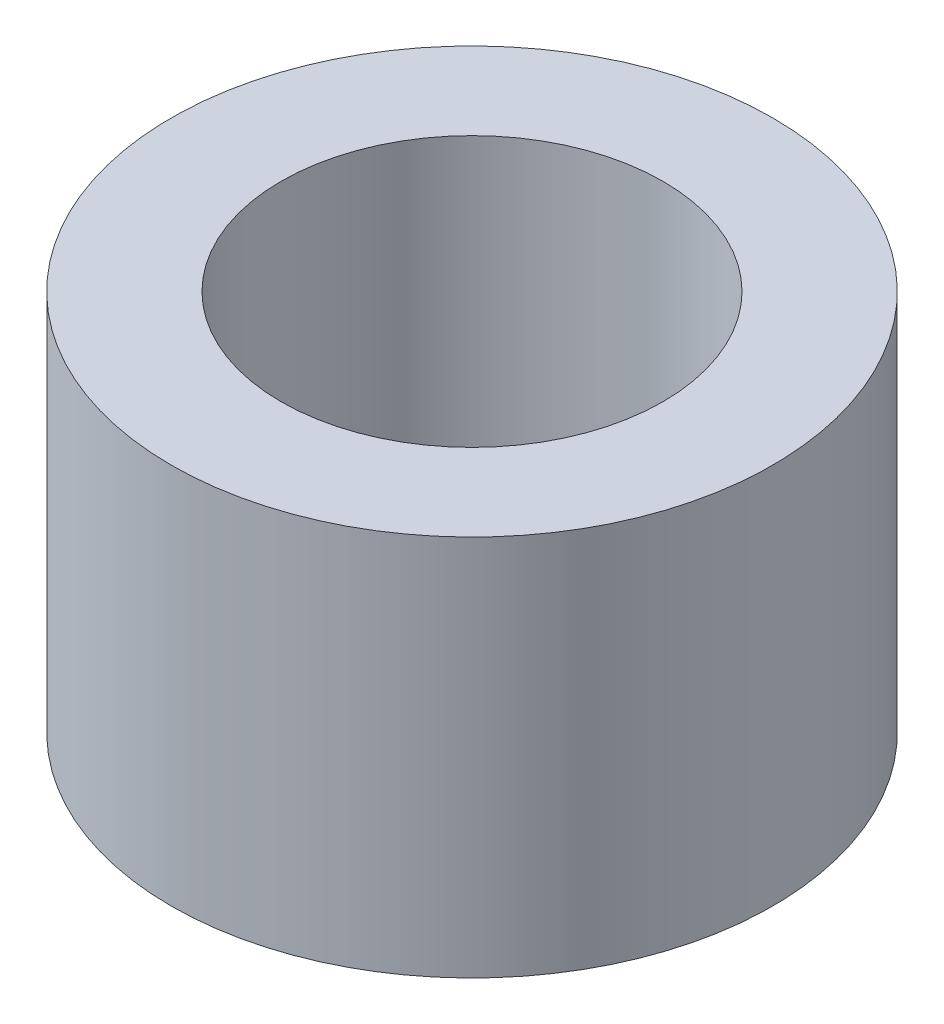
ISO-10303-21;
HEADER;
FILE_DESCRIPTION(('STEP AP214'),'2;1');
FILE_NAME('part.step','',(''),(''),'','','');
FILE_SCHEMA(('AUTOMOTIVE_DESIGN { 1 0 10303 214 1 1 1 1 }'));
ENDSEC;
DATA;
#1=APPLICATION_CONTEXT('core data for automotive mechanical design processes');
#2=APPLICATION_PROTOCOL_DEFINITION('international standard','automotive_design',2000,#1);
#3=PRODUCT_CONTEXT('',#1,'mechanical');
#4=PRODUCT('Part','Part','',(#3));
#5=PRODUCT_RELATED_PRODUCT_CATEGORY('part','',(#4));
#6=PRODUCT_DEFINITION_FORMATION('','',#4);
#7=PRODUCT_DEFINITION_CONTEXT('part definition',#1,'design');
#8=PRODUCT_DEFINITION('design','',#6,#7);
#9=PRODUCT_DEFINITION_SHAPE('','',#8);
#10=(LENGTH_UNIT() NAMED_UNIT(*) SI_UNIT(.MILLI.,.METRE.));
#11=(NAMED_UNIT(*) PLANE_ANGLE_UNIT() SI_UNIT($,.RADIAN.));
#12=(NAMED_UNIT(*) SI_UNIT($,.STERADIAN.) SOLID_ANGLE_UNIT());
#13=UNCERTAINTY_MEASURE_WITH_UNIT(LENGTH_MEASURE(1.E-05),#10,'distance_accuracy_value','');
#14=(GEOMETRIC_REPRESENTATION_CONTEXT(3) GLOBAL_UNCERTAINTY_ASSIGNED_CONTEXT((#13)) GLOBAL_UNIT_ASSIGNED_CONTEXT((#10,
#11,#12)) REPRESENTATION_CONTEXT('',''));
#15=CARTESIAN_POINT('',(0.,0.,0.));
#16=DIRECTION('',(0.,0.,1.));
#17=DIRECTION('',(1.,0.,0.));
#18=AXIS2_PLACEMENT_3D('',#15,#16,#17);
#19=CARTESIAN_POINT('',(2.,4.,0.));
#20=DIRECTION('',(0.,1.,0.));
#21=DIRECTION('',(0.,0.,-1.));
#22=AXIS2_PLACEMENT_3D('',#19,#20,#21);
#23=PLANE('',#22);
#24=CARTESIAN_POINT('',(0.,4.,0.));
#25=DIRECTION('',(0.,1.,0.));
#26=DIRECTION('',(0.,0.,1.));
#27=AXIS2_PLACEMENT_3D('',#24,#25,#26);
#28=CIRCLE('',#27,2.);
#29=CARTESIAN_POINT('',(0.,4.,2.));
#30=VERTEX_POINT('',#29);
#31=EDGE_CURVE('E55',#30,#30,#28,.T.);
#32=ORIENTED_EDGE('',*,*,#31,.F.);
#33=EDGE_LOOP('',(#32));
#34=FACE_BOUND('',#33,.T.);
#35=CARTESIAN_POINT('',(0.,4.,0.));
#36=DIRECTION('',(0.,1.,0.));
#37=DIRECTION('',(0.,0.,1.));
#38=AXIS2_PLACEMENT_3D('',#35,#36,#37);
#39=CIRCLE('',#38,3.15);
#40=CARTESIAN_POINT('',(0.,4.,3.15));
#41=VERTEX_POINT('',#40);
#42=EDGE_CURVE('E10',#41,#41,#39,.T.);
#43=ORIENTED_EDGE('',*,*,#42,.T.);
#44=EDGE_LOOP('',(#43));
#45=FACE_BOUND('',#44,.T.);
#46=ADVANCED_FACE('F41',(#34,#45),#23,.T.);
#47=CARTESIAN_POINT('',(0.,0.,0.));
#48=DIRECTION('',(0.,-1.,0.));
#49=DIRECTION('',(0.,0.,1.));
#50=AXIS2_PLACEMENT_3D('',#47,#48,#49);
#51=CYLINDRICAL_SURFACE('',#50,3.15);
#52=ORIENTED_EDGE('',*,*,#42,.F.);
#53=EDGE_LOOP('',(#52));
#54=FACE_BOUND('',#53,.T.);
#55=CARTESIAN_POINT('',(0.,0.,0.));
#56=DIRECTION('',(0.,1.,0.));
#57=DIRECTION('',(0.,0.,1.));
#58=AXIS2_PLACEMENT_3D('',#55,#56,#57);
#59=CIRCLE('',#58,3.15);
#60=CARTESIAN_POINT('',(0.,0.,3.15));
#61=VERTEX_POINT('',#60);
#62=EDGE_CURVE('E47',#61,#61,#59,.T.);
#63=ORIENTED_EDGE('',*,*,#62,.T.);
#64=EDGE_LOOP('',(#63));
#65=FACE_BOUND('',#64,.T.);
#66=ADVANCED_FACE('F64',(#54,#65),#51,.T.);
#67=CARTESIAN_POINT('',(3.15,0.,0.));
#68=DIRECTION('',(0.,-1.,0.));
#69=DIRECTION('',(0.,0.,1.));
#70=AXIS2_PLACEMENT_3D('',#67,#68,#69);
#71=PLANE('',#70);
#72=ORIENTED_EDGE('',*,*,#62,.F.);
#73=EDGE_LOOP('',(#72));
#74=FACE_BOUND('',#73,.T.);
#75=CARTESIAN_POINT('',(0.,0.,0.));
#76=DIRECTION('',(0.,1.,0.));
#77=DIRECTION('',(0.,0.,1.));
#78=AXIS2_PLACEMENT_3D('',#75,#76,#77);
#79=CIRCLE('',#78,2.);
#80=CARTESIAN_POINT('',(0.,0.,2.));
#81=VERTEX_POINT('',#80);
#82=EDGE_CURVE('E51',#81,#81,#79,.T.);
#83=ORIENTED_EDGE('',*,*,#82,.T.);
#84=EDGE_LOOP('',(#83));
#85=FACE_BOUND('',#84,.T.);
#86=ADVANCED_FACE('F68',(#74,#85),#71,.T.);
#87=CARTESIAN_POINT('',(0.,0.,0.));
#88=DIRECTION('',(0.,-1.,0.));
#89=DIRECTION('',(0.,0.,1.));
#90=AXIS2_PLACEMENT_3D('',#87,#88,#89);
#91=CYLINDRICAL_SURFACE('',#90,2.);
#92=ORIENTED_EDGE('',*,*,#82,.F.);
#93=EDGE_LOOP('',(#92));
#94=FACE_BOUND('',#93,.T.);
#95=ORIENTED_EDGE('',*,*,#31,.T.);
#96=EDGE_LOOP('',(#95));
#97=FACE_BOUND('',#96,.T.);
#98=ADVANCED_FACE('F61',(#94,#97),#91,.F.);
#99=CLOSED_SHELL('',(#46,#66,#86,#98));
#100=MANIFOLD_SOLID_BREP('B2',#99);
#101=ADVANCED_BREP_SHAPE_REPRESENTATION('',(#18,#100),#14);
#102=SHAPE_DEFINITION_REPRESENTATION(#9,#101);
ENDSEC;
END-ISO-10303-21;
